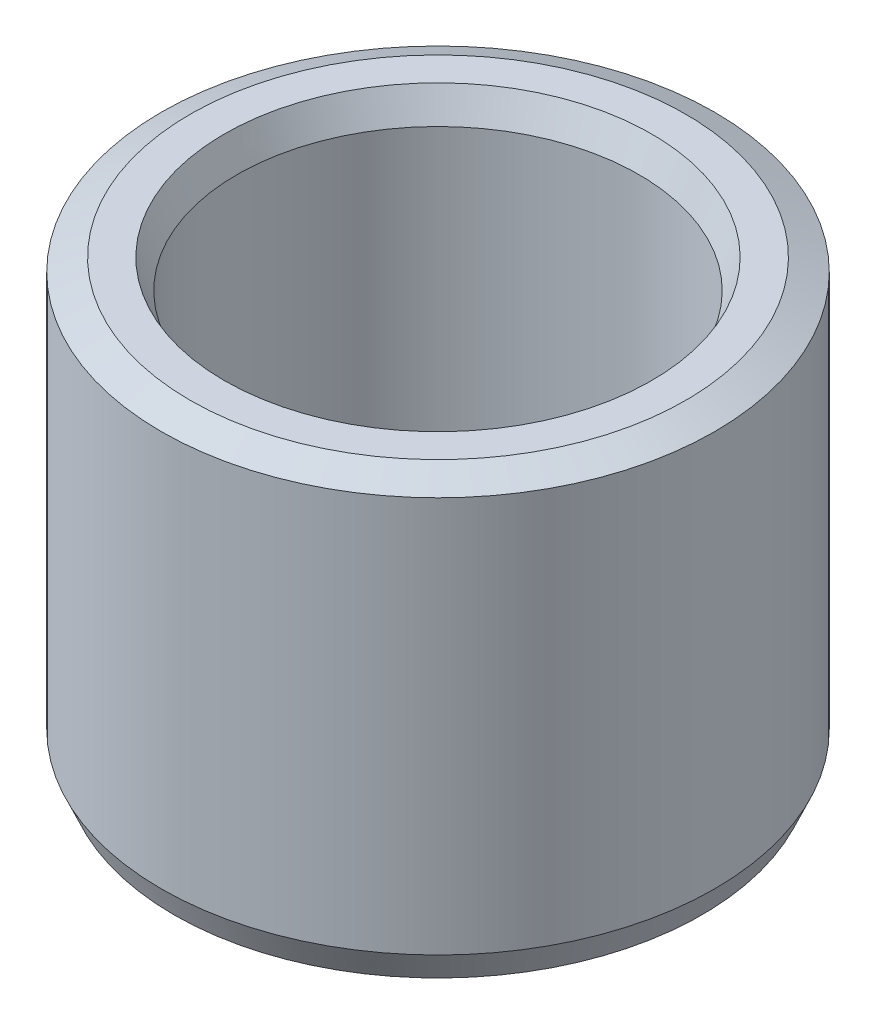
ISO-10303-21;
HEADER;
FILE_DESCRIPTION(('STEP AP214'),'2;1');
FILE_NAME('part.step','',(''),(''),'','','');
FILE_SCHEMA(('AUTOMOTIVE_DESIGN { 1 0 10303 214 1 1 1 1 }'));
ENDSEC;
DATA;
#1=APPLICATION_CONTEXT('core data for automotive mechanical design processes');
#2=APPLICATION_PROTOCOL_DEFINITION('international standard','automotive_design',2000,#1);
#3=PRODUCT_CONTEXT('',#1,'mechanical');
#4=PRODUCT('Part','Part','',(#3));
#5=PRODUCT_RELATED_PRODUCT_CATEGORY('part','',(#4));
#6=PRODUCT_DEFINITION_FORMATION('','',#4);
#7=PRODUCT_DEFINITION_CONTEXT('part definition',#1,'design');
#8=PRODUCT_DEFINITION('design','',#6,#7);
#9=PRODUCT_DEFINITION_SHAPE('','',#8);
#10=(LENGTH_UNIT() NAMED_UNIT(*) SI_UNIT(.MILLI.,.METRE.));
#11=(NAMED_UNIT(*) PLANE_ANGLE_UNIT() SI_UNIT($,.RADIAN.));
#12=(NAMED_UNIT(*) SI_UNIT($,.STERADIAN.) SOLID_ANGLE_UNIT());
#13=UNCERTAINTY_MEASURE_WITH_UNIT(LENGTH_MEASURE(1.E-05),#10,'distance_accuracy_value','');
#14=(GEOMETRIC_REPRESENTATION_CONTEXT(3) GLOBAL_UNCERTAINTY_ASSIGNED_CONTEXT((#13)) GLOBAL_UNIT_ASSIGNED_CONTEXT((#10,
#11,#12)) REPRESENTATION_CONTEXT('',''));
#15=CARTESIAN_POINT('',(0.,0.,0.));
#16=DIRECTION('',(0.,0.,1.));
#17=DIRECTION('',(1.,0.,0.));
#18=AXIS2_PLACEMENT_3D('',#15,#16,#17);
#19=CARTESIAN_POINT('',(0.,90.9256903970978,0.));
#20=DIRECTION('',(0.,-1.,0.));
#21=DIRECTION('',(0.,0.,-1.));
#22=AXIS2_PLACEMENT_3D('',#19,#20,#21);
#23=CYLINDRICAL_SURFACE('',#22,57.5);
#24=CARTESIAN_POINT('',(0.,5.99908140378425,0.));
#25=DIRECTION('',(0.,1.,0.));
#26=DIRECTION('',(0.,0.,1.));
#27=AXIS2_PLACEMENT_3D('',#24,#25,#26);
#28=CIRCLE('',#27,57.5);
#29=CARTESIAN_POINT('',(0.,5.99908140378425,57.5));
#30=VERTEX_POINT('',#29);
#31=EDGE_CURVE('E10',#30,#30,#28,.T.);
#32=ORIENTED_EDGE('',*,*,#31,.T.);
#33=EDGE_LOOP('',(#32));
#34=FACE_BOUND('',#33,.T.);
#35=CARTESIAN_POINT('',(0.,88.2936956313122,0.));
#36=DIRECTION('',(0.,1.,0.));
#37=DIRECTION('',(0.,0.,1.));
#38=AXIS2_PLACEMENT_3D('',#35,#36,#37);
#39=CIRCLE('',#38,57.5);
#40=CARTESIAN_POINT('',(0.,88.2936956313122,57.5));
#41=VERTEX_POINT('',#40);
#42=EDGE_CURVE('E50',#41,#41,#39,.F.);
#43=ORIENTED_EDGE('',*,*,#42,.T.);
#44=EDGE_LOOP('',(#43));
#45=FACE_BOUND('',#44,.T.);
#46=ADVANCED_FACE('F39',(#34,#45),#23,.T.);
#47=CARTESIAN_POINT('',(0.,90.9256903970978,0.));
#48=DIRECTION('',(0.,1.,0.));
#49=DIRECTION('',(0.,0.,1.));
#50=AXIS2_PLACEMENT_3D('',#47,#48,#49);
#51=PLANE('',#50);
#52=CARTESIAN_POINT('',(0.,90.9256903970978,0.));
#53=DIRECTION('',(0.,1.,0.));
#54=DIRECTION('',(0.,0.,1.));
#55=AXIS2_PLACEMENT_3D('',#52,#53,#54);
#56=CIRCLE('',#55,44.4039197824926);
#57=CARTESIAN_POINT('',(0.,90.9256903970978,44.4039197824926));
#58=VERTEX_POINT('',#57);
#59=EDGE_CURVE('E58',#58,#58,#56,.F.);
#60=ORIENTED_EDGE('',*,*,#59,.T.);
#61=EDGE_LOOP('',(#60));
#62=FACE_BOUND('',#61,.T.);
#63=CARTESIAN_POINT('',(0.,90.9256903970978,0.));
#64=DIRECTION('',(0.,1.,0.));
#65=DIRECTION('',(0.,0.,1.));
#66=AXIS2_PLACEMENT_3D('',#63,#64,#65);
#67=CIRCLE('',#66,51.5009185962157);
#68=CARTESIAN_POINT('',(0.,90.9256903970978,51.5009185962157));
#69=VERTEX_POINT('',#68);
#70=EDGE_CURVE('E61',#69,#69,#67,.T.);
#71=ORIENTED_EDGE('',*,*,#70,.T.);
#72=EDGE_LOOP('',(#71));
#73=FACE_BOUND('',#72,.T.);
#74=ADVANCED_FACE('F88',(#62,#73),#51,.T.);
#75=CARTESIAN_POINT('',(0.,0.,0.));
#76=DIRECTION('',(0.,1.,0.));
#77=DIRECTION('',(0.,0.,1.));
#78=AXIS2_PLACEMENT_3D('',#75,#76,#77);
#79=PLANE('',#78);
#80=CARTESIAN_POINT('',(0.,0.,0.));
#81=DIRECTION('',(0.,1.,0.));
#82=DIRECTION('',(0.,0.,1.));
#83=AXIS2_PLACEMENT_3D('',#80,#81,#82);
#84=CIRCLE('',#83,47.7710064204913);
#85=CARTESIAN_POINT('',(0.,0.,47.7710064204913));
#86=VERTEX_POINT('',#85);
#87=EDGE_CURVE('E51',#86,#86,#84,.T.);
#88=ORIENTED_EDGE('',*,*,#87,.T.);
#89=EDGE_LOOP('',(#88));
#90=FACE_BOUND('',#89,.T.);
#91=CARTESIAN_POINT('',(0.,0.,0.));
#92=DIRECTION('',(0.,1.,0.));
#93=DIRECTION('',(0.,0.,1.));
#94=AXIS2_PLACEMENT_3D('',#91,#92,#93);
#95=CIRCLE('',#94,54.8680052342144);
#96=CARTESIAN_POINT('',(0.,0.,54.8680052342144));
#97=VERTEX_POINT('',#96);
#98=EDGE_CURVE('E54',#97,#97,#95,.F.);
#99=ORIENTED_EDGE('',*,*,#98,.T.);
#100=EDGE_LOOP('',(#99));
#101=FACE_BOUND('',#100,.T.);
#102=ADVANCED_FACE('F83',(#90,#101),#79,.F.);
#103=CARTESIAN_POINT('',(0.,90.9256903970978,0.));
#104=DIRECTION('',(0.,-1.,0.));
#105=DIRECTION('',(0.,0.,-1.));
#106=AXIS2_PLACEMENT_3D('',#103,#104,#105);
#107=CYLINDRICAL_SURFACE('',#106,41.771925016707);
#108=CARTESIAN_POINT('',(0.,84.9266089933136,0.));
#109=DIRECTION('',(0.,1.,0.));
#110=DIRECTION('',(0.,0.,1.));
#111=AXIS2_PLACEMENT_3D('',#108,#109,#110);
#112=CIRCLE('',#111,41.771925016707);
#113=CARTESIAN_POINT('',(0.,84.9266089933136,41.771925016707));
#114=VERTEX_POINT('',#113);
#115=EDGE_CURVE('E67',#114,#114,#112,.T.);
#116=ORIENTED_EDGE('',*,*,#115,.T.);
#117=EDGE_LOOP('',(#116));
#118=FACE_BOUND('',#117,.T.);
#119=CARTESIAN_POINT('',(0.,2.63199476578563,0.));
#120=DIRECTION('',(0.,1.,0.));
#121=DIRECTION('',(0.,0.,1.));
#122=AXIS2_PLACEMENT_3D('',#119,#120,#121);
#123=CIRCLE('',#122,41.771925016707);
#124=CARTESIAN_POINT('',(0.,2.63199476578563,41.771925016707));
#125=VERTEX_POINT('',#124);
#126=EDGE_CURVE('E69',#125,#125,#123,.F.);
#127=ORIENTED_EDGE('',*,*,#126,.T.);
#128=EDGE_LOOP('',(#127));
#129=FACE_BOUND('',#128,.T.);
#130=ADVANCED_FACE('F71',(#118,#129),#107,.F.);
#131=CARTESIAN_POINT('',(0.,84.9266089933136,0.));
#132=DIRECTION('',(0.,1.,0.));
#133=DIRECTION('',(0.,0.,1.));
#134=AXIS2_PLACEMENT_3D('',#131,#132,#133);
#135=CONICAL_SURFACE('',#134,41.771925016707,0.413444854177701);
#136=ORIENTED_EDGE('',*,*,#59,.F.);
#137=EDGE_LOOP('',(#136));
#138=FACE_BOUND('',#137,.T.);
#139=ORIENTED_EDGE('',*,*,#115,.F.);
#140=EDGE_LOOP('',(#139));
#141=FACE_BOUND('',#140,.T.);
#142=ADVANCED_FACE('F77',(#138,#141),#135,.F.);
#143=CARTESIAN_POINT('',(0.,0.,0.));
#144=DIRECTION('',(0.,-1.,0.));
#145=DIRECTION('',(0.,0.,-1.));
#146=AXIS2_PLACEMENT_3D('',#143,#144,#145);
#147=CONICAL_SURFACE('',#146,47.7710064204913,1.1573514726172);
#148=ORIENTED_EDGE('',*,*,#126,.F.);
#149=EDGE_LOOP('',(#148));
#150=FACE_BOUND('',#149,.T.);
#151=ORIENTED_EDGE('',*,*,#87,.F.);
#152=EDGE_LOOP('',(#151));
#153=FACE_BOUND('',#152,.T.);
#154=ADVANCED_FACE('F73',(#150,#153),#147,.F.);
#155=CARTESIAN_POINT('',(0.,5.99908140378425,0.));
#156=DIRECTION('',(0.,1.,0.));
#157=DIRECTION('',(0.,0.,1.));
#158=AXIS2_PLACEMENT_3D('',#155,#156,#157);
#159=CONICAL_SURFACE('',#158,57.5,0.413444854177698);
#160=ORIENTED_EDGE('',*,*,#98,.F.);
#161=EDGE_LOOP('',(#160));
#162=FACE_BOUND('',#161,.T.);
#163=ORIENTED_EDGE('',*,*,#31,.F.);
#164=EDGE_LOOP('',(#163));
#165=FACE_BOUND('',#164,.T.);
#166=ADVANCED_FACE('F76',(#162,#165),#159,.T.);
#167=CARTESIAN_POINT('',(0.,90.9256903970978,0.));
#168=DIRECTION('',(0.,-1.,0.));
#169=DIRECTION('',(0.,0.,-1.));
#170=AXIS2_PLACEMENT_3D('',#167,#168,#169);
#171=CONICAL_SURFACE('',#170,51.5009185962157,1.1573514726172);
#172=ORIENTED_EDGE('',*,*,#42,.F.);
#173=EDGE_LOOP('',(#172));
#174=FACE_BOUND('',#173,.T.);
#175=ORIENTED_EDGE('',*,*,#70,.F.);
#176=EDGE_LOOP('',(#175));
#177=FACE_BOUND('',#176,.T.);
#178=ADVANCED_FACE('F45',(#174,#177),#171,.T.);
#179=CLOSED_SHELL('',(#46,#74,#102,#130,#142,#154,#166,#178));
#180=MANIFOLD_SOLID_BREP('B2',#179);
#181=ADVANCED_BREP_SHAPE_REPRESENTATION('',(#18,#180),#14);
#182=SHAPE_DEFINITION_REPRESENTATION(#9,#181);
ENDSEC;
END-ISO-10303-21;
